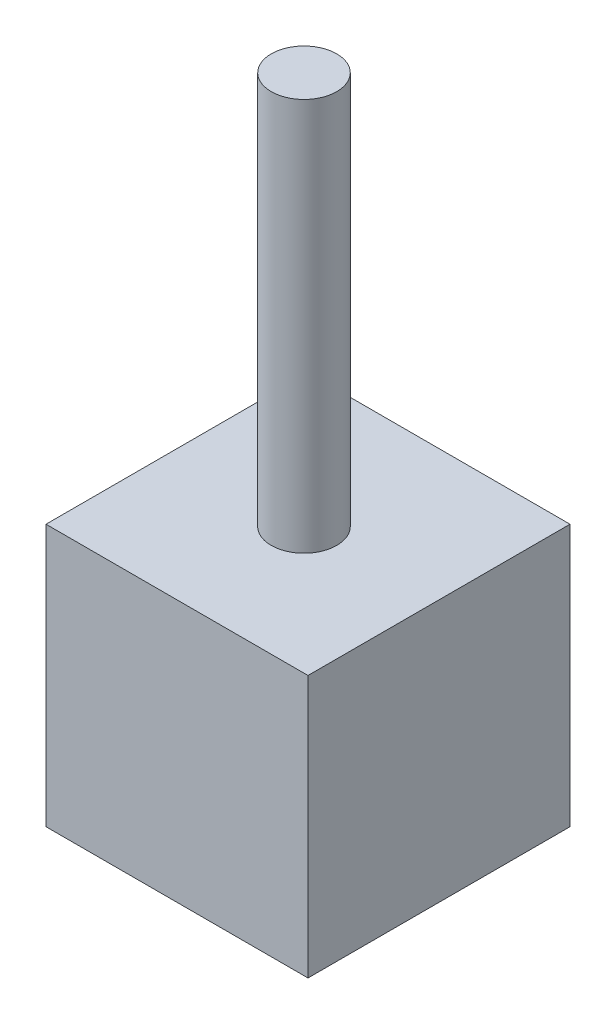
ISO-10303-21;
HEADER;
FILE_DESCRIPTION(('STEP AP214'),'2;1');
FILE_NAME('part.step','',(''),(''),'','','');
FILE_SCHEMA(('AUTOMOTIVE_DESIGN { 1 0 10303 214 1 1 1 1 }'));
ENDSEC;
DATA;
#1=APPLICATION_CONTEXT('core data for automotive mechanical design processes');
#2=APPLICATION_PROTOCOL_DEFINITION('international standard','automotive_design',2000,#1);
#3=PRODUCT_CONTEXT('',#1,'mechanical');
#4=PRODUCT('Part','Part','',(#3));
#5=PRODUCT_RELATED_PRODUCT_CATEGORY('part','',(#4));
#6=PRODUCT_DEFINITION_FORMATION('','',#4);
#7=PRODUCT_DEFINITION_CONTEXT('part definition',#1,'design');
#8=PRODUCT_DEFINITION('design','',#6,#7);
#9=PRODUCT_DEFINITION_SHAPE('','',#8);
#10=(LENGTH_UNIT() NAMED_UNIT(*) SI_UNIT(.MILLI.,.METRE.));
#11=(NAMED_UNIT(*) PLANE_ANGLE_UNIT() SI_UNIT($,.RADIAN.));
#12=(NAMED_UNIT(*) SI_UNIT($,.STERADIAN.) SOLID_ANGLE_UNIT());
#13=UNCERTAINTY_MEASURE_WITH_UNIT(LENGTH_MEASURE(1.E-05),#10,'distance_accuracy_value','');
#14=(GEOMETRIC_REPRESENTATION_CONTEXT(3) GLOBAL_UNCERTAINTY_ASSIGNED_CONTEXT((#13)) GLOBAL_UNIT_ASSIGNED_CONTEXT((#10,
#11,#12)) REPRESENTATION_CONTEXT('',''));
#15=CARTESIAN_POINT('',(0.,0.,0.));
#16=DIRECTION('',(0.,0.,1.));
#17=DIRECTION('',(1.,0.,0.));
#18=AXIS2_PLACEMENT_3D('',#15,#16,#17);
#19=CARTESIAN_POINT('',(-25.4,50.8,24.6201754385965));
#20=DIRECTION('',(1.,0.,0.));
#21=DIRECTION('',(0.,0.,-1.));
#22=AXIS2_PLACEMENT_3D('',#19,#20,#21);
#23=PLANE('',#22);
#24=DIRECTION('',(0.,0.,1.));
#25=VECTOR('',#24,1.);
#26=CARTESIAN_POINT('',(-25.4,0.,24.6201754385965));
#27=LINE('',#26,#25);
#28=CARTESIAN_POINT('',(-25.4,0.,-26.1798245614035));
#29=VERTEX_POINT('',#28);
#30=CARTESIAN_POINT('',(-25.4,0.,24.6201754385965));
#31=VERTEX_POINT('',#30);
#32=EDGE_CURVE('E110',#29,#31,#27,.T.);
#33=ORIENTED_EDGE('',*,*,#32,.T.);
#34=DIRECTION('',(0.,-1.,0.));
#35=VECTOR('',#34,1.);
#36=CARTESIAN_POINT('',(-25.4,50.8,24.6201754385965));
#37=LINE('',#36,#35);
#38=CARTESIAN_POINT('',(-25.4,50.8,24.6201754385965));
#39=VERTEX_POINT('',#38);
#40=EDGE_CURVE('E42',#39,#31,#37,.T.);
#41=ORIENTED_EDGE('',*,*,#40,.F.);
#42=DIRECTION('',(0.,0.,1.));
#43=VECTOR('',#42,1.);
#44=CARTESIAN_POINT('',(-25.4,50.8,24.6201754385965));
#45=LINE('',#44,#43);
#46=CARTESIAN_POINT('',(-25.4,50.8,-26.1798245614035));
#47=VERTEX_POINT('',#46);
#48=EDGE_CURVE('E93',#47,#39,#45,.T.);
#49=ORIENTED_EDGE('',*,*,#48,.F.);
#50=DIRECTION('',(0.,-1.,0.));
#51=VECTOR('',#50,1.);
#52=CARTESIAN_POINT('',(-25.4,50.8,-26.1798245614035));
#53=LINE('',#52,#51);
#54=EDGE_CURVE('E106',#47,#29,#53,.T.);
#55=ORIENTED_EDGE('',*,*,#54,.T.);
#56=EDGE_LOOP('',(#33,#41,#49,#55));
#57=FACE_BOUND('',#56,.T.);
#58=ADVANCED_FACE('F39',(#57),#23,.F.);
#59=CARTESIAN_POINT('',(-25.4,50.8,24.6201754385965));
#60=DIRECTION('',(0.,0.,-1.));
#61=DIRECTION('',(-1.,0.,0.));
#62=AXIS2_PLACEMENT_3D('',#59,#60,#61);
#63=PLANE('',#62);
#64=DIRECTION('',(1.,0.,0.));
#65=VECTOR('',#64,1.);
#66=CARTESIAN_POINT('',(-25.4,0.,24.6201754385965));
#67=LINE('',#66,#65);
#68=CARTESIAN_POINT('',(25.4,0.,24.6201754385965));
#69=VERTEX_POINT('',#68);
#70=EDGE_CURVE('E99',#31,#69,#67,.T.);
#71=ORIENTED_EDGE('',*,*,#70,.T.);
#72=DIRECTION('',(0.,-1.,0.));
#73=VECTOR('',#72,1.);
#74=CARTESIAN_POINT('',(25.4,50.8,24.6201754385965));
#75=LINE('',#74,#73);
#76=CARTESIAN_POINT('',(25.4,50.8,24.6201754385965));
#77=VERTEX_POINT('',#76);
#78=EDGE_CURVE('E97',#77,#69,#75,.T.);
#79=ORIENTED_EDGE('',*,*,#78,.F.);
#80=DIRECTION('',(1.,0.,0.));
#81=VECTOR('',#80,1.);
#82=CARTESIAN_POINT('',(-25.4,50.8,24.6201754385965));
#83=LINE('',#82,#81);
#84=EDGE_CURVE('E88',#39,#77,#83,.T.);
#85=ORIENTED_EDGE('',*,*,#84,.F.);
#86=ORIENTED_EDGE('',*,*,#40,.T.);
#87=EDGE_LOOP('',(#71,#79,#85,#86));
#88=FACE_BOUND('',#87,.T.);
#89=ADVANCED_FACE('F98',(#88),#63,.F.);
#90=CARTESIAN_POINT('',(25.4,50.8,24.6201754385965));
#91=DIRECTION('',(-1.,0.,0.));
#92=DIRECTION('',(0.,0.,1.));
#93=AXIS2_PLACEMENT_3D('',#90,#91,#92);
#94=PLANE('',#93);
#95=DIRECTION('',(0.,0.,-1.));
#96=VECTOR('',#95,1.);
#97=CARTESIAN_POINT('',(25.4,0.,24.6201754385965));
#98=LINE('',#97,#96);
#99=CARTESIAN_POINT('',(25.4,0.,-26.1798245614035));
#100=VERTEX_POINT('',#99);
#101=EDGE_CURVE('E74',#69,#100,#98,.T.);
#102=ORIENTED_EDGE('',*,*,#101,.T.);
#103=DIRECTION('',(0.,-1.,0.));
#104=VECTOR('',#103,1.);
#105=CARTESIAN_POINT('',(25.4,50.8,-26.1798245614035));
#106=LINE('',#105,#104);
#107=CARTESIAN_POINT('',(25.4,50.8,-26.1798245614035));
#108=VERTEX_POINT('',#107);
#109=EDGE_CURVE('E101',#108,#100,#106,.T.);
#110=ORIENTED_EDGE('',*,*,#109,.F.);
#111=DIRECTION('',(0.,0.,-1.));
#112=VECTOR('',#111,1.);
#113=CARTESIAN_POINT('',(25.4,50.8,24.6201754385965));
#114=LINE('',#113,#112);
#115=EDGE_CURVE('E91',#77,#108,#114,.T.);
#116=ORIENTED_EDGE('',*,*,#115,.F.);
#117=ORIENTED_EDGE('',*,*,#78,.T.);
#118=EDGE_LOOP('',(#102,#110,#116,#117));
#119=FACE_BOUND('',#118,.T.);
#120=ADVANCED_FACE('F102',(#119),#94,.F.);
#121=CARTESIAN_POINT('',(-25.4,50.8,-26.1798245614035));
#122=DIRECTION('',(0.,0.,1.));
#123=DIRECTION('',(1.,0.,0.));
#124=AXIS2_PLACEMENT_3D('',#121,#122,#123);
#125=PLANE('',#124);
#126=DIRECTION('',(-1.,0.,0.));
#127=VECTOR('',#126,1.);
#128=CARTESIAN_POINT('',(-25.4,0.,-26.1798245614035));
#129=LINE('',#128,#127);
#130=EDGE_CURVE('E80',#100,#29,#129,.T.);
#131=ORIENTED_EDGE('',*,*,#130,.T.);
#132=ORIENTED_EDGE('',*,*,#54,.F.);
#133=DIRECTION('',(-1.,0.,0.));
#134=VECTOR('',#133,1.);
#135=CARTESIAN_POINT('',(-25.4,50.8,-26.1798245614035));
#136=LINE('',#135,#134);
#137=EDGE_CURVE('E57',#108,#47,#136,.T.);
#138=ORIENTED_EDGE('',*,*,#137,.F.);
#139=ORIENTED_EDGE('',*,*,#109,.T.);
#140=EDGE_LOOP('',(#131,#132,#138,#139));
#141=FACE_BOUND('',#140,.T.);
#142=ADVANCED_FACE('F124',(#141),#125,.F.);
#143=CARTESIAN_POINT('',(0.,50.8,0.));
#144=DIRECTION('',(0.,-1.,0.));
#145=DIRECTION('',(0.,0.,-1.));
#146=AXIS2_PLACEMENT_3D('',#143,#144,#145);
#147=PLANE('',#146);
#148=CARTESIAN_POINT('',(0.,50.8,0.));
#149=DIRECTION('',(0.,1.,0.));
#150=DIRECTION('',(0.,0.,1.));
#151=AXIS2_PLACEMENT_3D('',#148,#149,#150);
#152=CIRCLE('',#151,6.35);
#153=CARTESIAN_POINT('',(0.,50.8,6.35));
#154=VERTEX_POINT('',#153);
#155=EDGE_CURVE('E11',#154,#154,#152,.T.);
#156=ORIENTED_EDGE('',*,*,#155,.F.);
#157=EDGE_LOOP('',(#156));
#158=FACE_BOUND('',#157,.T.);
#159=ORIENTED_EDGE('',*,*,#48,.T.);
#160=ORIENTED_EDGE('',*,*,#84,.T.);
#161=ORIENTED_EDGE('',*,*,#115,.T.);
#162=ORIENTED_EDGE('',*,*,#137,.T.);
#163=EDGE_LOOP('',(#159,#160,#161,#162));
#164=FACE_BOUND('',#163,.T.);
#165=ADVANCED_FACE('F89',(#158,#164),#147,.F.);
#166=CARTESIAN_POINT('',(0.,0.,0.));
#167=DIRECTION('',(0.,-1.,0.));
#168=DIRECTION('',(0.,0.,-1.));
#169=AXIS2_PLACEMENT_3D('',#166,#167,#168);
#170=PLANE('',#169);
#171=ORIENTED_EDGE('',*,*,#32,.F.);
#172=ORIENTED_EDGE('',*,*,#130,.F.);
#173=ORIENTED_EDGE('',*,*,#101,.F.);
#174=ORIENTED_EDGE('',*,*,#70,.F.);
#175=EDGE_LOOP('',(#171,#172,#173,#174));
#176=FACE_BOUND('',#175,.T.);
#177=ADVANCED_FACE('F127',(#176),#170,.T.);
#178=CARTESIAN_POINT('',(0.,127.,0.));
#179=DIRECTION('',(0.,-1.,0.));
#180=DIRECTION('',(0.,0.,-1.));
#181=AXIS2_PLACEMENT_3D('',#178,#179,#180);
#182=CYLINDRICAL_SURFACE('',#181,6.35);
#183=CARTESIAN_POINT('',(0.,127.,0.));
#184=DIRECTION('',(0.,1.,0.));
#185=DIRECTION('',(0.,0.,1.));
#186=AXIS2_PLACEMENT_3D('',#183,#184,#185);
#187=CIRCLE('',#186,6.35);
#188=CARTESIAN_POINT('',(0.,127.,6.35));
#189=VERTEX_POINT('',#188);
#190=EDGE_CURVE('E114',#189,#189,#187,.T.);
#191=ORIENTED_EDGE('',*,*,#190,.F.);
#192=EDGE_LOOP('',(#191));
#193=FACE_BOUND('',#192,.T.);
#194=ORIENTED_EDGE('',*,*,#155,.T.);
#195=EDGE_LOOP('',(#194));
#196=FACE_BOUND('',#195,.T.);
#197=ADVANCED_FACE('F137',(#193,#196),#182,.T.);
#198=CARTESIAN_POINT('',(0.,127.,0.));
#199=DIRECTION('',(0.,1.,0.));
#200=DIRECTION('',(0.,0.,1.));
#201=AXIS2_PLACEMENT_3D('',#198,#199,#200);
#202=PLANE('',#201);
#203=ORIENTED_EDGE('',*,*,#190,.T.);
#204=EDGE_LOOP('',(#203));
#205=FACE_BOUND('',#204,.T.);
#206=ADVANCED_FACE('F135',(#205),#202,.T.);
#207=CLOSED_SHELL('',(#58,#89,#120,#142,#165,#177,#197,#206));
#208=MANIFOLD_SOLID_BREP('B2',#207);
#209=ADVANCED_BREP_SHAPE_REPRESENTATION('',(#18,#208),#14);
#210=SHAPE_DEFINITION_REPRESENTATION(#9,#209);
ENDSEC;
END-ISO-10303-21;
